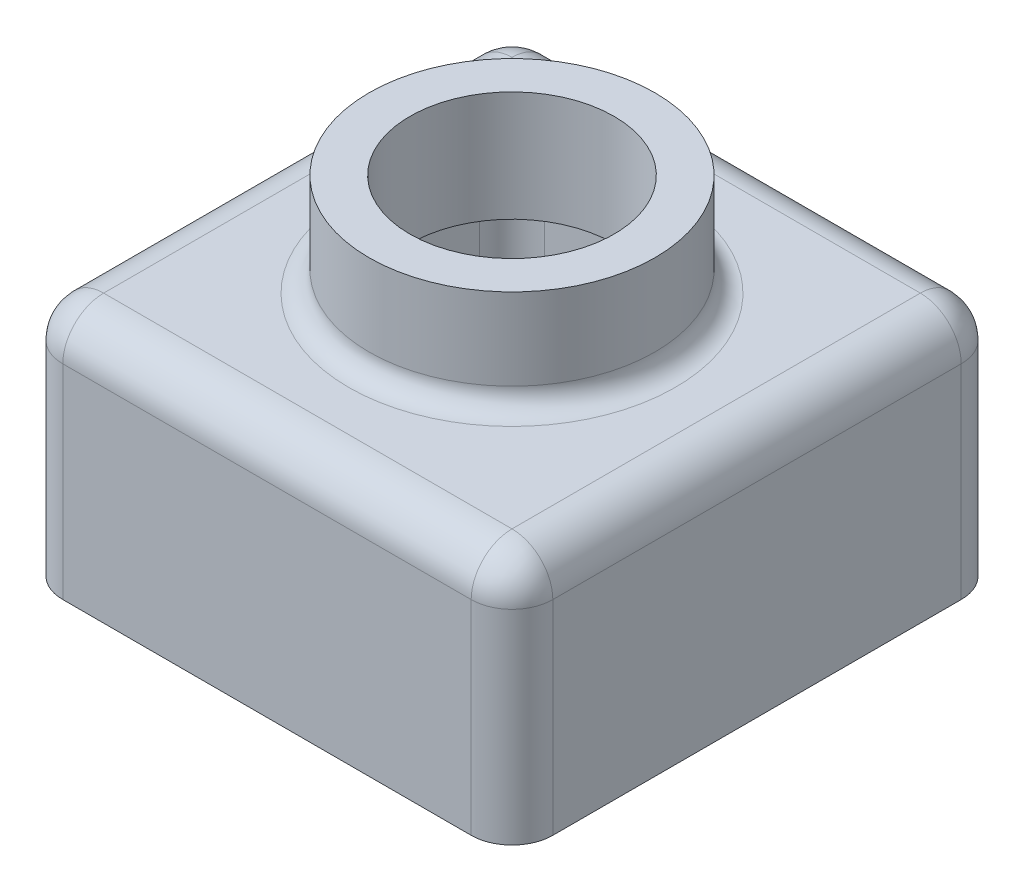
ISO-10303-21;
HEADER;
FILE_DESCRIPTION(('STEP AP214'),'2;1');
FILE_NAME('part.step','',(''),(''),'','','');
FILE_SCHEMA(('AUTOMOTIVE_DESIGN { 1 0 10303 214 1 1 1 1 }'));
ENDSEC;
DATA;
#1=APPLICATION_CONTEXT('core data for automotive mechanical design processes');
#2=APPLICATION_PROTOCOL_DEFINITION('international standard','automotive_design',2000,#1);
#3=PRODUCT_CONTEXT('',#1,'mechanical');
#4=PRODUCT('Part','Part','',(#3));
#5=PRODUCT_RELATED_PRODUCT_CATEGORY('part','',(#4));
#6=PRODUCT_DEFINITION_FORMATION('','',#4);
#7=PRODUCT_DEFINITION_CONTEXT('part definition',#1,'design');
#8=PRODUCT_DEFINITION('design','',#6,#7);
#9=PRODUCT_DEFINITION_SHAPE('','',#8);
#10=(LENGTH_UNIT() NAMED_UNIT(*) SI_UNIT(.MILLI.,.METRE.));
#11=(NAMED_UNIT(*) PLANE_ANGLE_UNIT() SI_UNIT($,.RADIAN.));
#12=(NAMED_UNIT(*) SI_UNIT($,.STERADIAN.) SOLID_ANGLE_UNIT());
#13=UNCERTAINTY_MEASURE_WITH_UNIT(LENGTH_MEASURE(1.E-05),#10,'distance_accuracy_value','');
#14=(GEOMETRIC_REPRESENTATION_CONTEXT(3) GLOBAL_UNCERTAINTY_ASSIGNED_CONTEXT((#13)) GLOBAL_UNIT_ASSIGNED_CONTEXT((#10,
#11,#12)) REPRESENTATION_CONTEXT('',''));
#15=CARTESIAN_POINT('',(0.,0.,0.));
#16=DIRECTION('',(0.,0.,1.));
#17=DIRECTION('',(1.,0.,0.));
#18=AXIS2_PLACEMENT_3D('',#15,#16,#17);
#19=CARTESIAN_POINT('',(0.,0.,0.));
#20=DIRECTION('',(0.,1.,0.));
#21=DIRECTION('',(0.,0.,1.));
#22=AXIS2_PLACEMENT_3D('',#19,#20,#21);
#23=PLANE('',#22);
#24=DIRECTION('',(0.,0.,1.));
#25=VECTOR('',#24,1.);
#26=CARTESIAN_POINT('',(-60.,0.,-60.));
#27=LINE('',#26,#25);
#28=CARTESIAN_POINT('',(-60.,0.,-50.));
#29=VERTEX_POINT('',#28);
#30=CARTESIAN_POINT('',(-60.,0.,50.));
#31=VERTEX_POINT('',#30);
#32=EDGE_CURVE('E336',#29,#31,#27,.T.);
#33=ORIENTED_EDGE('',*,*,#32,.F.);
#34=CARTESIAN_POINT('',(-50.,0.,-50.));
#35=DIRECTION('',(0.,1.,0.));
#36=DIRECTION('',(0.,0.,1.));
#37=AXIS2_PLACEMENT_3D('',#34,#35,#36);
#38=CIRCLE('',#37,10.);
#39=CARTESIAN_POINT('',(-50.,0.,-60.));
#40=VERTEX_POINT('',#39);
#41=EDGE_CURVE('E402',#29,#40,#38,.F.);
#42=ORIENTED_EDGE('',*,*,#41,.T.);
#43=DIRECTION('',(-1.,0.,0.));
#44=VECTOR('',#43,1.);
#45=CARTESIAN_POINT('',(-60.,0.,-60.));
#46=LINE('',#45,#44);
#47=CARTESIAN_POINT('',(50.,0.,-60.));
#48=VERTEX_POINT('',#47);
#49=EDGE_CURVE('E331',#48,#40,#46,.T.);
#50=ORIENTED_EDGE('',*,*,#49,.F.);
#51=CARTESIAN_POINT('',(50.,0.,-50.));
#52=DIRECTION('',(0.,1.,0.));
#53=DIRECTION('',(0.,0.,1.));
#54=AXIS2_PLACEMENT_3D('',#51,#52,#53);
#55=CIRCLE('',#54,10.);
#56=CARTESIAN_POINT('',(60.,0.,-50.));
#57=VERTEX_POINT('',#56);
#58=EDGE_CURVE('E399',#48,#57,#55,.F.);
#59=ORIENTED_EDGE('',*,*,#58,.T.);
#60=DIRECTION('',(0.,0.,-1.));
#61=VECTOR('',#60,1.);
#62=CARTESIAN_POINT('',(60.,0.,-60.));
#63=LINE('',#62,#61);
#64=CARTESIAN_POINT('',(60.,0.,50.));
#65=VERTEX_POINT('',#64);
#66=EDGE_CURVE('E328',#65,#57,#63,.T.);
#67=ORIENTED_EDGE('',*,*,#66,.F.);
#68=CARTESIAN_POINT('',(50.,0.,50.));
#69=DIRECTION('',(0.,1.,0.));
#70=DIRECTION('',(0.,0.,1.));
#71=AXIS2_PLACEMENT_3D('',#68,#69,#70);
#72=CIRCLE('',#71,10.);
#73=CARTESIAN_POINT('',(50.,0.,60.));
#74=VERTEX_POINT('',#73);
#75=EDGE_CURVE('E396',#65,#74,#72,.F.);
#76=ORIENTED_EDGE('',*,*,#75,.T.);
#77=DIRECTION('',(1.,0.,0.));
#78=VECTOR('',#77,1.);
#79=CARTESIAN_POINT('',(-60.,0.,60.));
#80=LINE('',#79,#78);
#81=CARTESIAN_POINT('',(-50.,0.,60.));
#82=VERTEX_POINT('',#81);
#83=EDGE_CURVE('E340',#82,#74,#80,.T.);
#84=ORIENTED_EDGE('',*,*,#83,.F.);
#85=CARTESIAN_POINT('',(-50.,0.,50.));
#86=DIRECTION('',(0.,1.,0.));
#87=DIRECTION('',(0.,0.,1.));
#88=AXIS2_PLACEMENT_3D('',#85,#86,#87);
#89=CIRCLE('',#88,10.);
#90=EDGE_CURVE('E393',#82,#31,#89,.F.);
#91=ORIENTED_EDGE('',*,*,#90,.T.);
#92=EDGE_LOOP('',(#33,#42,#50,#59,#67,#76,#84,#91));
#93=FACE_BOUND('',#92,.T.);
#94=CARTESIAN_POINT('',(-50.,0.,-50.));
#95=DIRECTION('',(0.,1.,0.));
#96=DIRECTION('',(0.,0.,1.));
#97=AXIS2_PLACEMENT_3D('',#94,#95,#96);
#98=CIRCLE('',#97,8.);
#99=CARTESIAN_POINT('',(-58.,0.,-50.));
#100=VERTEX_POINT('',#99);
#101=CARTESIAN_POINT('',(-50.,0.,-58.));
#102=VERTEX_POINT('',#101);
#103=EDGE_CURVE('E319',#100,#102,#98,.F.);
#104=ORIENTED_EDGE('',*,*,#103,.F.);
#105=DIRECTION('',(0.,0.,1.));
#106=VECTOR('',#105,1.);
#107=CARTESIAN_POINT('',(-58.,0.,-60.));
#108=LINE('',#107,#106);
#109=CARTESIAN_POINT('',(-58.,0.,50.));
#110=VERTEX_POINT('',#109);
#111=EDGE_CURVE('E313',#100,#110,#108,.T.);
#112=ORIENTED_EDGE('',*,*,#111,.T.);
#113=CARTESIAN_POINT('',(-50.,0.,50.));
#114=DIRECTION('',(0.,1.,0.));
#115=DIRECTION('',(0.,0.,1.));
#116=AXIS2_PLACEMENT_3D('',#113,#114,#115);
#117=CIRCLE('',#116,8.);
#118=CARTESIAN_POINT('',(-50.,0.,58.));
#119=VERTEX_POINT('',#118);
#120=EDGE_CURVE('E197',#119,#110,#117,.F.);
#121=ORIENTED_EDGE('',*,*,#120,.F.);
#122=DIRECTION('',(1.,0.,0.));
#123=VECTOR('',#122,1.);
#124=CARTESIAN_POINT('',(-60.,0.,58.));
#125=LINE('',#124,#123);
#126=CARTESIAN_POINT('',(50.,0.,58.));
#127=VERTEX_POINT('',#126);
#128=EDGE_CURVE('E61',#119,#127,#125,.T.);
#129=ORIENTED_EDGE('',*,*,#128,.T.);
#130=CARTESIAN_POINT('',(50.,0.,50.));
#131=DIRECTION('',(0.,1.,0.));
#132=DIRECTION('',(0.,0.,1.));
#133=AXIS2_PLACEMENT_3D('',#130,#131,#132);
#134=CIRCLE('',#133,8.);
#135=CARTESIAN_POINT('',(58.,0.,50.));
#136=VERTEX_POINT('',#135);
#137=EDGE_CURVE('E308',#136,#127,#134,.F.);
#138=ORIENTED_EDGE('',*,*,#137,.F.);
#139=DIRECTION('',(0.,0.,-1.));
#140=VECTOR('',#139,1.);
#141=CARTESIAN_POINT('',(58.,0.,-60.));
#142=LINE('',#141,#140);
#143=CARTESIAN_POINT('',(58.,0.,-50.));
#144=VERTEX_POINT('',#143);
#145=EDGE_CURVE('E247',#136,#144,#142,.T.);
#146=ORIENTED_EDGE('',*,*,#145,.T.);
#147=CARTESIAN_POINT('',(50.,0.,-50.));
#148=DIRECTION('',(0.,1.,0.));
#149=DIRECTION('',(0.,0.,1.));
#150=AXIS2_PLACEMENT_3D('',#147,#148,#149);
#151=CIRCLE('',#150,8.);
#152=CARTESIAN_POINT('',(50.,0.,-58.));
#153=VERTEX_POINT('',#152);
#154=EDGE_CURVE('E191',#153,#144,#151,.F.);
#155=ORIENTED_EDGE('',*,*,#154,.F.);
#156=DIRECTION('',(-1.,0.,0.));
#157=VECTOR('',#156,1.);
#158=CARTESIAN_POINT('',(-60.,0.,-58.));
#159=LINE('',#158,#157);
#160=EDGE_CURVE('E307',#153,#102,#159,.T.);
#161=ORIENTED_EDGE('',*,*,#160,.T.);
#162=EDGE_LOOP('',(#104,#112,#121,#129,#138,#146,#155,#161));
#163=FACE_BOUND('',#162,.T.);
#164=ADVANCED_FACE('F45',(#93,#163),#23,.F.);
#165=CARTESIAN_POINT('',(60.,60.,-60.));
#166=DIRECTION('',(-1.,0.,0.));
#167=DIRECTION('',(0.,0.,1.));
#168=AXIS2_PLACEMENT_3D('',#165,#166,#167);
#169=PLANE('',#168);
#170=ORIENTED_EDGE('',*,*,#66,.T.);
#171=DIRECTION('',(0.,-1.,0.));
#172=VECTOR('',#171,1.);
#173=CARTESIAN_POINT('',(60.,60.,-50.));
#174=LINE('',#173,#172);
#175=CARTESIAN_POINT('',(60.,50.,-50.));
#176=VERTEX_POINT('',#175);
#177=EDGE_CURVE('E69',#57,#176,#174,.F.);
#178=ORIENTED_EDGE('',*,*,#177,.T.);
#179=DIRECTION('',(0.,0.,-1.));
#180=VECTOR('',#179,1.);
#181=CARTESIAN_POINT('',(60.,50.,60.));
#182=LINE('',#181,#180);
#183=CARTESIAN_POINT('',(60.,50.,50.));
#184=VERTEX_POINT('',#183);
#185=EDGE_CURVE('E388',#176,#184,#182,.F.);
#186=ORIENTED_EDGE('',*,*,#185,.T.);
#187=DIRECTION('',(0.,-1.,0.));
#188=VECTOR('',#187,1.);
#189=CARTESIAN_POINT('',(60.,60.,50.));
#190=LINE('',#189,#188);
#191=EDGE_CURVE('E385',#184,#65,#190,.T.);
#192=ORIENTED_EDGE('',*,*,#191,.T.);
#193=EDGE_LOOP('',(#170,#178,#186,#192));
#194=FACE_BOUND('',#193,.T.);
#195=ADVANCED_FACE('F467',(#194),#169,.F.);
#196=CARTESIAN_POINT('',(-60.,60.,-60.));
#197=DIRECTION('',(0.,0.,1.));
#198=DIRECTION('',(1.,0.,0.));
#199=AXIS2_PLACEMENT_3D('',#196,#197,#198);
#200=PLANE('',#199);
#201=ORIENTED_EDGE('',*,*,#49,.T.);
#202=DIRECTION('',(0.,-1.,0.));
#203=VECTOR('',#202,1.);
#204=CARTESIAN_POINT('',(-50.,60.,-60.));
#205=LINE('',#204,#203);
#206=CARTESIAN_POINT('',(-50.,50.,-60.));
#207=VERTEX_POINT('',#206);
#208=EDGE_CURVE('E382',#40,#207,#205,.F.);
#209=ORIENTED_EDGE('',*,*,#208,.T.);
#210=DIRECTION('',(-1.,0.,0.));
#211=VECTOR('',#210,1.);
#212=CARTESIAN_POINT('',(60.,50.,-60.));
#213=LINE('',#212,#211);
#214=CARTESIAN_POINT('',(50.,50.,-60.));
#215=VERTEX_POINT('',#214);
#216=EDGE_CURVE('E379',#207,#215,#213,.F.);
#217=ORIENTED_EDGE('',*,*,#216,.T.);
#218=DIRECTION('',(0.,-1.,0.));
#219=VECTOR('',#218,1.);
#220=CARTESIAN_POINT('',(50.,60.,-60.));
#221=LINE('',#220,#219);
#222=EDGE_CURVE('E376',#215,#48,#221,.T.);
#223=ORIENTED_EDGE('',*,*,#222,.T.);
#224=EDGE_LOOP('',(#201,#209,#217,#223));
#225=FACE_BOUND('',#224,.T.);
#226=ADVANCED_FACE('F475',(#225),#200,.F.);
#227=CARTESIAN_POINT('',(-60.,60.,-60.));
#228=DIRECTION('',(1.,0.,0.));
#229=DIRECTION('',(0.,0.,-1.));
#230=AXIS2_PLACEMENT_3D('',#227,#228,#229);
#231=PLANE('',#230);
#232=DIRECTION('',(0.,0.,1.));
#233=VECTOR('',#232,1.);
#234=CARTESIAN_POINT('',(-60.,50.,-60.));
#235=LINE('',#234,#233);
#236=CARTESIAN_POINT('',(-60.,50.,50.));
#237=VERTEX_POINT('',#236);
#238=CARTESIAN_POINT('',(-60.,50.,-50.));
#239=VERTEX_POINT('',#238);
#240=EDGE_CURVE('E370',#237,#239,#235,.F.);
#241=ORIENTED_EDGE('',*,*,#240,.T.);
#242=DIRECTION('',(0.,-1.,0.));
#243=VECTOR('',#242,1.);
#244=CARTESIAN_POINT('',(-60.,60.,-50.));
#245=LINE('',#244,#243);
#246=EDGE_CURVE('E373',#239,#29,#245,.T.);
#247=ORIENTED_EDGE('',*,*,#246,.T.);
#248=ORIENTED_EDGE('',*,*,#32,.T.);
#249=DIRECTION('',(0.,-1.,0.));
#250=VECTOR('',#249,1.);
#251=CARTESIAN_POINT('',(-60.,60.,50.));
#252=LINE('',#251,#250);
#253=EDGE_CURVE('E367',#31,#237,#252,.F.);
#254=ORIENTED_EDGE('',*,*,#253,.T.);
#255=EDGE_LOOP('',(#241,#247,#248,#254));
#256=FACE_BOUND('',#255,.T.);
#257=ADVANCED_FACE('F486',(#256),#231,.F.);
#258=CARTESIAN_POINT('',(-60.,60.,60.));
#259=DIRECTION('',(0.,0.,-1.));
#260=DIRECTION('',(-1.,0.,0.));
#261=AXIS2_PLACEMENT_3D('',#258,#259,#260);
#262=PLANE('',#261);
#263=ORIENTED_EDGE('',*,*,#83,.T.);
#264=DIRECTION('',(0.,-1.,0.));
#265=VECTOR('',#264,1.);
#266=CARTESIAN_POINT('',(50.,60.,60.));
#267=LINE('',#266,#265);
#268=CARTESIAN_POINT('',(50.,50.,60.));
#269=VERTEX_POINT('',#268);
#270=EDGE_CURVE('E364',#74,#269,#267,.F.);
#271=ORIENTED_EDGE('',*,*,#270,.T.);
#272=DIRECTION('',(1.,0.,0.));
#273=VECTOR('',#272,1.);
#274=CARTESIAN_POINT('',(-60.,50.,60.));
#275=LINE('',#274,#273);
#276=CARTESIAN_POINT('',(-50.,50.,60.));
#277=VERTEX_POINT('',#276);
#278=EDGE_CURVE('E360',#269,#277,#275,.F.);
#279=ORIENTED_EDGE('',*,*,#278,.T.);
#280=DIRECTION('',(0.,-1.,0.));
#281=VECTOR('',#280,1.);
#282=CARTESIAN_POINT('',(-50.,60.,60.));
#283=LINE('',#282,#281);
#284=EDGE_CURVE('E357',#277,#82,#283,.T.);
#285=ORIENTED_EDGE('',*,*,#284,.T.);
#286=EDGE_LOOP('',(#263,#271,#279,#285));
#287=FACE_BOUND('',#286,.T.);
#288=ADVANCED_FACE('F483',(#287),#262,.F.);
#289=CARTESIAN_POINT('',(0.,60.,0.));
#290=DIRECTION('',(0.,1.,0.));
#291=DIRECTION('',(0.,0.,1.));
#292=AXIS2_PLACEMENT_3D('',#289,#290,#291);
#293=PLANE('',#292);
#294=CARTESIAN_POINT('',(0.,60.,0.));
#295=DIRECTION('',(0.,1.,0.));
#296=DIRECTION('',(0.,0.,1.));
#297=AXIS2_PLACEMENT_3D('',#294,#295,#296);
#298=CIRCLE('',#297,40.);
#299=CARTESIAN_POINT('',(0.,60.,40.));
#300=VERTEX_POINT('',#299);
#301=EDGE_CURVE('E11',#300,#300,#298,.F.);
#302=ORIENTED_EDGE('',*,*,#301,.T.);
#303=EDGE_LOOP('',(#302));
#304=FACE_BOUND('',#303,.T.);
#305=DIRECTION('',(0.,0.,1.));
#306=VECTOR('',#305,1.);
#307=CARTESIAN_POINT('',(-50.,60.,60.));
#308=LINE('',#307,#306);
#309=CARTESIAN_POINT('',(-50.,60.,-50.));
#310=VERTEX_POINT('',#309);
#311=CARTESIAN_POINT('',(-50.,60.,50.));
#312=VERTEX_POINT('',#311);
#313=EDGE_CURVE('E350',#310,#312,#308,.T.);
#314=ORIENTED_EDGE('',*,*,#313,.T.);
#315=DIRECTION('',(1.,0.,0.));
#316=VECTOR('',#315,1.);
#317=CARTESIAN_POINT('',(60.,60.,50.));
#318=LINE('',#317,#316);
#319=CARTESIAN_POINT('',(50.,60.,50.));
#320=VERTEX_POINT('',#319);
#321=EDGE_CURVE('E353',#312,#320,#318,.T.);
#322=ORIENTED_EDGE('',*,*,#321,.T.);
#323=DIRECTION('',(0.,0.,-1.));
#324=VECTOR('',#323,1.);
#325=CARTESIAN_POINT('',(50.,60.,-60.));
#326=LINE('',#325,#324);
#327=CARTESIAN_POINT('',(50.,60.,-50.));
#328=VERTEX_POINT('',#327);
#329=EDGE_CURVE('E344',#320,#328,#326,.T.);
#330=ORIENTED_EDGE('',*,*,#329,.T.);
#331=DIRECTION('',(-1.,0.,0.));
#332=VECTOR('',#331,1.);
#333=CARTESIAN_POINT('',(-60.,60.,-50.));
#334=LINE('',#333,#332);
#335=EDGE_CURVE('E347',#328,#310,#334,.T.);
#336=ORIENTED_EDGE('',*,*,#335,.T.);
#337=EDGE_LOOP('',(#314,#322,#330,#336));
#338=FACE_BOUND('',#337,.T.);
#339=ADVANCED_FACE('F481',(#304,#338),#293,.T.);
#340=CARTESIAN_POINT('',(-50.,60.,-50.));
#341=DIRECTION('',(0.,-1.,0.));
#342=DIRECTION('',(0.,0.,-1.));
#343=AXIS2_PLACEMENT_3D('',#340,#341,#342);
#344=CYLINDRICAL_SURFACE('',#343,10.);
#345=ORIENTED_EDGE('',*,*,#41,.F.);
#346=ORIENTED_EDGE('',*,*,#246,.F.);
#347=CARTESIAN_POINT('',(-50.,50.,-50.));
#348=DIRECTION('',(0.,1.,0.));
#349=DIRECTION('',(0.,0.,1.));
#350=AXIS2_PLACEMENT_3D('',#347,#348,#349);
#351=CIRCLE('',#350,10.);
#352=EDGE_CURVE('E332',#207,#239,#351,.T.);
#353=ORIENTED_EDGE('',*,*,#352,.F.);
#354=ORIENTED_EDGE('',*,*,#208,.F.);
#355=EDGE_LOOP('',(#345,#346,#353,#354));
#356=FACE_BOUND('',#355,.T.);
#357=ADVANCED_FACE('F535',(#356),#344,.T.);
#358=CARTESIAN_POINT('',(0.,50.,-50.));
#359=DIRECTION('',(1.,0.,0.));
#360=DIRECTION('',(0.,0.,-1.));
#361=AXIS2_PLACEMENT_3D('',#358,#359,#360);
#362=CYLINDRICAL_SURFACE('',#361,10.);
#363=CARTESIAN_POINT('',(50.,50.,-50.));
#364=DIRECTION('',(1.,0.,0.));
#365=DIRECTION('',(0.,1.,0.));
#366=AXIS2_PLACEMENT_3D('',#363,#364,#365);
#367=CIRCLE('',#366,10.);
#368=EDGE_CURVE('E438',#215,#328,#367,.T.);
#369=ORIENTED_EDGE('',*,*,#368,.F.);
#370=ORIENTED_EDGE('',*,*,#216,.F.);
#371=CARTESIAN_POINT('',(-50.,50.,-50.));
#372=DIRECTION('',(-1.,0.,0.));
#373=DIRECTION('',(0.,0.,1.));
#374=AXIS2_PLACEMENT_3D('',#371,#372,#373);
#375=CIRCLE('',#374,10.);
#376=EDGE_CURVE('E442',#310,#207,#375,.T.);
#377=ORIENTED_EDGE('',*,*,#376,.F.);
#378=ORIENTED_EDGE('',*,*,#335,.F.);
#379=EDGE_LOOP('',(#369,#370,#377,#378));
#380=FACE_BOUND('',#379,.T.);
#381=ADVANCED_FACE('F532',(#380),#362,.T.);
#382=CARTESIAN_POINT('',(50.,60.,-50.));
#383=DIRECTION('',(0.,-1.,0.));
#384=DIRECTION('',(0.,0.,-1.));
#385=AXIS2_PLACEMENT_3D('',#382,#383,#384);
#386=CYLINDRICAL_SURFACE('',#385,10.);
#387=ORIENTED_EDGE('',*,*,#58,.F.);
#388=ORIENTED_EDGE('',*,*,#222,.F.);
#389=CARTESIAN_POINT('',(50.,50.,-50.));
#390=DIRECTION('',(0.,1.,0.));
#391=DIRECTION('',(0.,0.,1.));
#392=AXIS2_PLACEMENT_3D('',#389,#390,#391);
#393=CIRCLE('',#392,10.);
#394=EDGE_CURVE('E434',#176,#215,#393,.T.);
#395=ORIENTED_EDGE('',*,*,#394,.F.);
#396=ORIENTED_EDGE('',*,*,#177,.F.);
#397=EDGE_LOOP('',(#387,#388,#395,#396));
#398=FACE_BOUND('',#397,.T.);
#399=ADVANCED_FACE('F528',(#398),#386,.T.);
#400=CARTESIAN_POINT('',(-50.,50.,-50.));
#401=DIRECTION('',(0.,0.,-1.));
#402=DIRECTION('',(-1.,0.,0.));
#403=AXIS2_PLACEMENT_3D('',#400,#401,#402);
#404=SPHERICAL_SURFACE('',#403,10.);
#405=ORIENTED_EDGE('',*,*,#376,.T.);
#406=ORIENTED_EDGE('',*,*,#352,.T.);
#407=CARTESIAN_POINT('',(-50.,50.,-50.));
#408=DIRECTION('',(0.,0.,-1.));
#409=DIRECTION('',(-1.,0.,0.));
#410=AXIS2_PLACEMENT_3D('',#407,#408,#409);
#411=CIRCLE('',#410,10.);
#412=EDGE_CURVE('E430',#310,#239,#411,.F.);
#413=ORIENTED_EDGE('',*,*,#412,.F.);
#414=EDGE_LOOP('',(#405,#406,#413));
#415=FACE_BOUND('',#414,.T.);
#416=ADVANCED_FACE('F524',(#415),#404,.T.);
#417=CARTESIAN_POINT('',(50.,50.,-50.));
#418=DIRECTION('',(0.,0.,-1.));
#419=DIRECTION('',(-1.,0.,0.));
#420=AXIS2_PLACEMENT_3D('',#417,#418,#419);
#421=SPHERICAL_SURFACE('',#420,10.);
#422=ORIENTED_EDGE('',*,*,#394,.T.);
#423=ORIENTED_EDGE('',*,*,#368,.T.);
#424=CARTESIAN_POINT('',(50.,50.,-50.));
#425=DIRECTION('',(0.,0.,-1.));
#426=DIRECTION('',(-1.,0.,0.));
#427=AXIS2_PLACEMENT_3D('',#424,#425,#426);
#428=CIRCLE('',#427,10.);
#429=EDGE_CURVE('E426',#176,#328,#428,.F.);
#430=ORIENTED_EDGE('',*,*,#429,.F.);
#431=EDGE_LOOP('',(#422,#423,#430));
#432=FACE_BOUND('',#431,.T.);
#433=ADVANCED_FACE('F520',(#432),#421,.T.);
#434=CARTESIAN_POINT('',(-50.,60.,50.));
#435=DIRECTION('',(0.,-1.,0.));
#436=DIRECTION('',(0.,0.,-1.));
#437=AXIS2_PLACEMENT_3D('',#434,#435,#436);
#438=CYLINDRICAL_SURFACE('',#437,10.);
#439=ORIENTED_EDGE('',*,*,#90,.F.);
#440=ORIENTED_EDGE('',*,*,#284,.F.);
#441=CARTESIAN_POINT('',(-50.,50.,50.));
#442=DIRECTION('',(0.,1.,0.));
#443=DIRECTION('',(0.,0.,1.));
#444=AXIS2_PLACEMENT_3D('',#441,#442,#443);
#445=CIRCLE('',#444,10.);
#446=EDGE_CURVE('E422',#237,#277,#445,.T.);
#447=ORIENTED_EDGE('',*,*,#446,.F.);
#448=ORIENTED_EDGE('',*,*,#253,.F.);
#449=EDGE_LOOP('',(#439,#440,#447,#448));
#450=FACE_BOUND('',#449,.T.);
#451=ADVANCED_FACE('F516',(#450),#438,.T.);
#452=CARTESIAN_POINT('',(-50.,50.,0.));
#453=DIRECTION('',(0.,0.,-1.));
#454=DIRECTION('',(-1.,0.,0.));
#455=AXIS2_PLACEMENT_3D('',#452,#453,#454);
#456=CYLINDRICAL_SURFACE('',#455,10.);
#457=ORIENTED_EDGE('',*,*,#412,.T.);
#458=ORIENTED_EDGE('',*,*,#240,.F.);
#459=CARTESIAN_POINT('',(-50.,50.,50.));
#460=DIRECTION('',(0.,0.,1.));
#461=DIRECTION('',(1.,0.,0.));
#462=AXIS2_PLACEMENT_3D('',#459,#460,#461);
#463=CIRCLE('',#462,10.);
#464=EDGE_CURVE('E418',#312,#237,#463,.T.);
#465=ORIENTED_EDGE('',*,*,#464,.F.);
#466=ORIENTED_EDGE('',*,*,#313,.F.);
#467=EDGE_LOOP('',(#457,#458,#465,#466));
#468=FACE_BOUND('',#467,.T.);
#469=ADVANCED_FACE('F512',(#468),#456,.T.);
#470=CARTESIAN_POINT('',(50.,50.,0.));
#471=DIRECTION('',(0.,0.,1.));
#472=DIRECTION('',(1.,0.,0.));
#473=AXIS2_PLACEMENT_3D('',#470,#471,#472);
#474=CYLINDRICAL_SURFACE('',#473,10.);
#475=ORIENTED_EDGE('',*,*,#429,.T.);
#476=ORIENTED_EDGE('',*,*,#329,.F.);
#477=CARTESIAN_POINT('',(50.,50.,50.));
#478=DIRECTION('',(0.,0.,1.));
#479=DIRECTION('',(0.,-1.,0.));
#480=AXIS2_PLACEMENT_3D('',#477,#478,#479);
#481=CIRCLE('',#480,10.);
#482=EDGE_CURVE('E414',#184,#320,#481,.T.);
#483=ORIENTED_EDGE('',*,*,#482,.F.);
#484=ORIENTED_EDGE('',*,*,#185,.F.);
#485=EDGE_LOOP('',(#475,#476,#483,#484));
#486=FACE_BOUND('',#485,.T.);
#487=ADVANCED_FACE('F508',(#486),#474,.T.);
#488=CARTESIAN_POINT('',(50.,60.,50.));
#489=DIRECTION('',(0.,-1.,0.));
#490=DIRECTION('',(0.,0.,-1.));
#491=AXIS2_PLACEMENT_3D('',#488,#489,#490);
#492=CYLINDRICAL_SURFACE('',#491,10.);
#493=ORIENTED_EDGE('',*,*,#75,.F.);
#494=ORIENTED_EDGE('',*,*,#191,.F.);
#495=CARTESIAN_POINT('',(50.,50.,50.));
#496=DIRECTION('',(0.,1.,0.));
#497=DIRECTION('',(0.,0.,1.));
#498=AXIS2_PLACEMENT_3D('',#495,#496,#497);
#499=CIRCLE('',#498,10.);
#500=EDGE_CURVE('E410',#269,#184,#499,.T.);
#501=ORIENTED_EDGE('',*,*,#500,.F.);
#502=ORIENTED_EDGE('',*,*,#270,.F.);
#503=EDGE_LOOP('',(#493,#494,#501,#502));
#504=FACE_BOUND('',#503,.T.);
#505=ADVANCED_FACE('F504',(#504),#492,.T.);
#506=CARTESIAN_POINT('',(-50.,50.,50.));
#507=DIRECTION('',(-1.,0.,0.));
#508=DIRECTION('',(0.,0.,1.));
#509=AXIS2_PLACEMENT_3D('',#506,#507,#508);
#510=SPHERICAL_SURFACE('',#509,10.);
#511=ORIENTED_EDGE('',*,*,#464,.T.);
#512=ORIENTED_EDGE('',*,*,#446,.T.);
#513=CARTESIAN_POINT('',(-50.,50.,50.));
#514=DIRECTION('',(-1.,0.,0.));
#515=DIRECTION('',(0.,0.,1.));
#516=AXIS2_PLACEMENT_3D('',#513,#514,#515);
#517=CIRCLE('',#516,10.);
#518=EDGE_CURVE('E407',#312,#277,#517,.F.);
#519=ORIENTED_EDGE('',*,*,#518,.F.);
#520=EDGE_LOOP('',(#511,#512,#519));
#521=FACE_BOUND('',#520,.T.);
#522=ADVANCED_FACE('F500',(#521),#510,.T.);
#523=CARTESIAN_POINT('',(50.,50.,50.));
#524=DIRECTION('',(1.,0.,0.));
#525=DIRECTION('',(0.,0.,-1.));
#526=AXIS2_PLACEMENT_3D('',#523,#524,#525);
#527=SPHERICAL_SURFACE('',#526,10.);
#528=ORIENTED_EDGE('',*,*,#500,.T.);
#529=ORIENTED_EDGE('',*,*,#482,.T.);
#530=CARTESIAN_POINT('',(50.,50.,50.));
#531=DIRECTION('',(1.,0.,0.));
#532=DIRECTION('',(0.,0.,-1.));
#533=AXIS2_PLACEMENT_3D('',#530,#531,#532);
#534=CIRCLE('',#533,10.);
#535=EDGE_CURVE('E322',#269,#320,#534,.F.);
#536=ORIENTED_EDGE('',*,*,#535,.F.);
#537=EDGE_LOOP('',(#528,#529,#536));
#538=FACE_BOUND('',#537,.T.);
#539=ADVANCED_FACE('F496',(#538),#527,.T.);
#540=CARTESIAN_POINT('',(0.,50.,50.));
#541=DIRECTION('',(-1.,0.,0.));
#542=DIRECTION('',(0.,0.,1.));
#543=AXIS2_PLACEMENT_3D('',#540,#541,#542);
#544=CYLINDRICAL_SURFACE('',#543,10.);
#545=ORIENTED_EDGE('',*,*,#518,.T.);
#546=ORIENTED_EDGE('',*,*,#278,.F.);
#547=ORIENTED_EDGE('',*,*,#535,.T.);
#548=ORIENTED_EDGE('',*,*,#321,.F.);
#549=EDGE_LOOP('',(#545,#546,#547,#548));
#550=FACE_BOUND('',#549,.T.);
#551=ADVANCED_FACE('F494',(#550),#544,.T.);
#552=CARTESIAN_POINT('',(58.,60.,-60.));
#553=DIRECTION('',(-1.,0.,0.));
#554=DIRECTION('',(0.,0.,1.));
#555=AXIS2_PLACEMENT_3D('',#552,#553,#554);
#556=PLANE('',#555);
#557=ORIENTED_EDGE('',*,*,#145,.F.);
#558=DIRECTION('',(0.,1.,0.));
#559=VECTOR('',#558,1.);
#560=CARTESIAN_POINT('',(58.,60.,50.));
#561=LINE('',#560,#559);
#562=CARTESIAN_POINT('',(58.,50.,50.));
#563=VERTEX_POINT('',#562);
#564=EDGE_CURVE('E222',#563,#136,#561,.F.);
#565=ORIENTED_EDGE('',*,*,#564,.F.);
#566=DIRECTION('',(0.,0.,1.));
#567=VECTOR('',#566,1.);
#568=CARTESIAN_POINT('',(58.,50.,-60.));
#569=LINE('',#568,#567);
#570=CARTESIAN_POINT('',(58.,50.,-50.));
#571=VERTEX_POINT('',#570);
#572=EDGE_CURVE('E198',#571,#563,#569,.T.);
#573=ORIENTED_EDGE('',*,*,#572,.F.);
#574=DIRECTION('',(0.,1.,0.));
#575=VECTOR('',#574,1.);
#576=CARTESIAN_POINT('',(58.,60.,-50.));
#577=LINE('',#576,#575);
#578=EDGE_CURVE('E186',#144,#571,#577,.T.);
#579=ORIENTED_EDGE('',*,*,#578,.F.);
#580=EDGE_LOOP('',(#557,#565,#573,#579));
#581=FACE_BOUND('',#580,.T.);
#582=ADVANCED_FACE('F221',(#581),#556,.T.);
#583=CARTESIAN_POINT('',(-60.,60.,-58.));
#584=DIRECTION('',(0.,0.,1.));
#585=DIRECTION('',(1.,0.,0.));
#586=AXIS2_PLACEMENT_3D('',#583,#584,#585);
#587=PLANE('',#586);
#588=ORIENTED_EDGE('',*,*,#160,.F.);
#589=DIRECTION('',(0.,1.,0.));
#590=VECTOR('',#589,1.);
#591=CARTESIAN_POINT('',(50.,60.,-58.));
#592=LINE('',#591,#590);
#593=CARTESIAN_POINT('',(50.,50.,-58.));
#594=VERTEX_POINT('',#593);
#595=EDGE_CURVE('E231',#594,#153,#592,.F.);
#596=ORIENTED_EDGE('',*,*,#595,.F.);
#597=DIRECTION('',(1.,0.,0.));
#598=VECTOR('',#597,1.);
#599=CARTESIAN_POINT('',(-60.,50.,-58.));
#600=LINE('',#599,#598);
#601=CARTESIAN_POINT('',(-50.,50.,-58.));
#602=VERTEX_POINT('',#601);
#603=EDGE_CURVE('E233',#602,#594,#600,.T.);
#604=ORIENTED_EDGE('',*,*,#603,.F.);
#605=DIRECTION('',(0.,1.,0.));
#606=VECTOR('',#605,1.);
#607=CARTESIAN_POINT('',(-50.,60.,-58.));
#608=LINE('',#607,#606);
#609=EDGE_CURVE('E227',#102,#602,#608,.T.);
#610=ORIENTED_EDGE('',*,*,#609,.F.);
#611=EDGE_LOOP('',(#588,#596,#604,#610));
#612=FACE_BOUND('',#611,.T.);
#613=ADVANCED_FACE('F732',(#612),#587,.T.);
#614=CARTESIAN_POINT('',(-58.,60.,-60.));
#615=DIRECTION('',(1.,0.,0.));
#616=DIRECTION('',(0.,0.,-1.));
#617=AXIS2_PLACEMENT_3D('',#614,#615,#616);
#618=PLANE('',#617);
#619=DIRECTION('',(0.,0.,-1.));
#620=VECTOR('',#619,1.);
#621=CARTESIAN_POINT('',(-58.,50.,-60.));
#622=LINE('',#621,#620);
#623=CARTESIAN_POINT('',(-58.,50.,50.));
#624=VERTEX_POINT('',#623);
#625=CARTESIAN_POINT('',(-58.,50.,-50.));
#626=VERTEX_POINT('',#625);
#627=EDGE_CURVE('E242',#624,#626,#622,.T.);
#628=ORIENTED_EDGE('',*,*,#627,.F.);
#629=DIRECTION('',(0.,1.,0.));
#630=VECTOR('',#629,1.);
#631=CARTESIAN_POINT('',(-58.,60.,50.));
#632=LINE('',#631,#630);
#633=EDGE_CURVE('E251',#110,#624,#632,.T.);
#634=ORIENTED_EDGE('',*,*,#633,.F.);
#635=ORIENTED_EDGE('',*,*,#111,.F.);
#636=DIRECTION('',(0.,1.,0.));
#637=VECTOR('',#636,1.);
#638=CARTESIAN_POINT('',(-58.,60.,-50.));
#639=LINE('',#638,#637);
#640=EDGE_CURVE('E234',#626,#100,#639,.F.);
#641=ORIENTED_EDGE('',*,*,#640,.F.);
#642=EDGE_LOOP('',(#628,#634,#635,#641));
#643=FACE_BOUND('',#642,.T.);
#644=ADVANCED_FACE('F724',(#643),#618,.T.);
#645=CARTESIAN_POINT('',(-60.,60.,58.));
#646=DIRECTION('',(0.,0.,-1.));
#647=DIRECTION('',(-1.,0.,0.));
#648=AXIS2_PLACEMENT_3D('',#645,#646,#647);
#649=PLANE('',#648);
#650=ORIENTED_EDGE('',*,*,#128,.F.);
#651=DIRECTION('',(0.,1.,0.));
#652=VECTOR('',#651,1.);
#653=CARTESIAN_POINT('',(-50.,60.,58.));
#654=LINE('',#653,#652);
#655=CARTESIAN_POINT('',(-50.,50.,58.));
#656=VERTEX_POINT('',#655);
#657=EDGE_CURVE('E269',#656,#119,#654,.F.);
#658=ORIENTED_EDGE('',*,*,#657,.F.);
#659=DIRECTION('',(-1.,0.,0.));
#660=VECTOR('',#659,1.);
#661=CARTESIAN_POINT('',(-60.,50.,58.));
#662=LINE('',#661,#660);
#663=CARTESIAN_POINT('',(50.,50.,58.));
#664=VERTEX_POINT('',#663);
#665=EDGE_CURVE('E287',#664,#656,#662,.T.);
#666=ORIENTED_EDGE('',*,*,#665,.F.);
#667=DIRECTION('',(0.,1.,0.));
#668=VECTOR('',#667,1.);
#669=CARTESIAN_POINT('',(50.,60.,58.));
#670=LINE('',#669,#668);
#671=EDGE_CURVE('E254',#127,#664,#670,.T.);
#672=ORIENTED_EDGE('',*,*,#671,.F.);
#673=EDGE_LOOP('',(#650,#658,#666,#672));
#674=FACE_BOUND('',#673,.T.);
#675=ADVANCED_FACE('F621',(#674),#649,.T.);
#676=CARTESIAN_POINT('',(0.,58.,0.));
#677=DIRECTION('',(0.,1.,0.));
#678=DIRECTION('',(0.,0.,1.));
#679=AXIS2_PLACEMENT_3D('',#676,#677,#678);
#680=PLANE('',#679);
#681=CARTESIAN_POINT('',(0.,58.,0.));
#682=DIRECTION('',(0.,1.,0.));
#683=DIRECTION('',(0.,0.,1.));
#684=AXIS2_PLACEMENT_3D('',#681,#682,#683);
#685=CIRCLE('',#684,25.);
#686=CARTESIAN_POINT('',(0.,58.,25.));
#687=VERTEX_POINT('',#686);
#688=EDGE_CURVE('E891',#687,#687,#685,.T.);
#689=ORIENTED_EDGE('',*,*,#688,.T.);
#690=EDGE_LOOP('',(#689));
#691=FACE_BOUND('',#690,.T.);
#692=DIRECTION('',(0.,0.,1.));
#693=VECTOR('',#692,1.);
#694=CARTESIAN_POINT('',(-50.,58.,0.));
#695=LINE('',#694,#693);
#696=CARTESIAN_POINT('',(-50.,58.,-50.));
#697=VERTEX_POINT('',#696);
#698=CARTESIAN_POINT('',(-50.,58.,50.));
#699=VERTEX_POINT('',#698);
#700=EDGE_CURVE('E261',#697,#699,#695,.T.);
#701=ORIENTED_EDGE('',*,*,#700,.F.);
#702=DIRECTION('',(1.,0.,0.));
#703=VECTOR('',#702,1.);
#704=CARTESIAN_POINT('',(0.,58.,-50.));
#705=LINE('',#704,#703);
#706=CARTESIAN_POINT('',(50.,58.,-50.));
#707=VERTEX_POINT('',#706);
#708=EDGE_CURVE('E265',#707,#697,#705,.F.);
#709=ORIENTED_EDGE('',*,*,#708,.F.);
#710=DIRECTION('',(0.,0.,1.));
#711=VECTOR('',#710,1.);
#712=CARTESIAN_POINT('',(50.,58.,0.));
#713=LINE('',#712,#711);
#714=CARTESIAN_POINT('',(50.,58.,50.));
#715=VERTEX_POINT('',#714);
#716=EDGE_CURVE('E216',#715,#707,#713,.F.);
#717=ORIENTED_EDGE('',*,*,#716,.F.);
#718=DIRECTION('',(1.,0.,0.));
#719=VECTOR('',#718,1.);
#720=CARTESIAN_POINT('',(0.,58.,50.));
#721=LINE('',#720,#719);
#722=EDGE_CURVE('E264',#699,#715,#721,.T.);
#723=ORIENTED_EDGE('',*,*,#722,.F.);
#724=EDGE_LOOP('',(#701,#709,#717,#723));
#725=FACE_BOUND('',#724,.T.);
#726=ADVANCED_FACE('F617',(#691,#725),#680,.F.);
#727=CARTESIAN_POINT('',(-50.,60.,-50.));
#728=DIRECTION('',(0.,-1.,0.));
#729=DIRECTION('',(0.,0.,-1.));
#730=AXIS2_PLACEMENT_3D('',#727,#728,#729);
#731=CYLINDRICAL_SURFACE('',#730,8.);
#732=ORIENTED_EDGE('',*,*,#103,.T.);
#733=ORIENTED_EDGE('',*,*,#609,.T.);
#734=CARTESIAN_POINT('',(-50.,50.,-50.));
#735=DIRECTION('',(0.,-1.,0.));
#736=DIRECTION('',(0.,0.,-1.));
#737=AXIS2_PLACEMENT_3D('',#734,#735,#736);
#738=CIRCLE('',#737,8.);
#739=EDGE_CURVE('E243',#602,#626,#738,.F.);
#740=ORIENTED_EDGE('',*,*,#739,.T.);
#741=ORIENTED_EDGE('',*,*,#640,.T.);
#742=EDGE_LOOP('',(#732,#733,#740,#741));
#743=FACE_BOUND('',#742,.T.);
#744=ADVANCED_FACE('F620',(#743),#731,.F.);
#745=CARTESIAN_POINT('',(0.,50.,-50.));
#746=DIRECTION('',(1.,0.,0.));
#747=DIRECTION('',(0.,0.,-1.));
#748=AXIS2_PLACEMENT_3D('',#745,#746,#747);
#749=CYLINDRICAL_SURFACE('',#748,8.);
#750=CARTESIAN_POINT('',(50.,50.,-50.));
#751=DIRECTION('',(-1.,0.,0.));
#752=DIRECTION('',(0.,0.,1.));
#753=AXIS2_PLACEMENT_3D('',#750,#751,#752);
#754=CIRCLE('',#753,8.);
#755=EDGE_CURVE('E207',#594,#707,#754,.F.);
#756=ORIENTED_EDGE('',*,*,#755,.T.);
#757=ORIENTED_EDGE('',*,*,#708,.T.);
#758=CARTESIAN_POINT('',(-50.,50.,-50.));
#759=DIRECTION('',(-1.,0.,0.));
#760=DIRECTION('',(0.,-1.,0.));
#761=AXIS2_PLACEMENT_3D('',#758,#759,#760);
#762=CIRCLE('',#761,8.);
#763=EDGE_CURVE('E248',#697,#602,#762,.T.);
#764=ORIENTED_EDGE('',*,*,#763,.T.);
#765=ORIENTED_EDGE('',*,*,#603,.T.);
#766=EDGE_LOOP('',(#756,#757,#764,#765));
#767=FACE_BOUND('',#766,.T.);
#768=ADVANCED_FACE('F702',(#767),#749,.F.);
#769=CARTESIAN_POINT('',(50.,60.,-50.));
#770=DIRECTION('',(0.,-1.,0.));
#771=DIRECTION('',(0.,0.,-1.));
#772=AXIS2_PLACEMENT_3D('',#769,#770,#771);
#773=CYLINDRICAL_SURFACE('',#772,8.);
#774=ORIENTED_EDGE('',*,*,#154,.T.);
#775=ORIENTED_EDGE('',*,*,#578,.T.);
#776=CARTESIAN_POINT('',(50.,50.,-50.));
#777=DIRECTION('',(0.,1.,0.));
#778=DIRECTION('',(-1.,0.,0.));
#779=AXIS2_PLACEMENT_3D('',#776,#777,#778);
#780=CIRCLE('',#779,8.);
#781=EDGE_CURVE('E189',#571,#594,#780,.T.);
#782=ORIENTED_EDGE('',*,*,#781,.T.);
#783=ORIENTED_EDGE('',*,*,#595,.T.);
#784=EDGE_LOOP('',(#774,#775,#782,#783));
#785=FACE_BOUND('',#784,.T.);
#786=ADVANCED_FACE('F188',(#785),#773,.F.);
#787=CARTESIAN_POINT('',(-50.,50.,-50.));
#788=DIRECTION('',(0.,0.,-1.));
#789=DIRECTION('',(-1.,0.,0.));
#790=AXIS2_PLACEMENT_3D('',#787,#788,#789);
#791=SPHERICAL_SURFACE('',#790,8.);
#792=ORIENTED_EDGE('',*,*,#763,.F.);
#793=CARTESIAN_POINT('',(-50.,50.,-50.));
#794=DIRECTION('',(0.,0.,-1.));
#795=DIRECTION('',(-1.,0.,0.));
#796=AXIS2_PLACEMENT_3D('',#793,#794,#795);
#797=CIRCLE('',#796,8.);
#798=EDGE_CURVE('E209',#697,#626,#797,.F.);
#799=ORIENTED_EDGE('',*,*,#798,.T.);
#800=ORIENTED_EDGE('',*,*,#739,.F.);
#801=EDGE_LOOP('',(#792,#799,#800));
#802=FACE_BOUND('',#801,.T.);
#803=ADVANCED_FACE('F686',(#802),#791,.F.);
#804=CARTESIAN_POINT('',(50.,50.,-50.));
#805=DIRECTION('',(0.,0.,-1.));
#806=DIRECTION('',(-1.,0.,0.));
#807=AXIS2_PLACEMENT_3D('',#804,#805,#806);
#808=SPHERICAL_SURFACE('',#807,8.);
#809=ORIENTED_EDGE('',*,*,#781,.F.);
#810=CARTESIAN_POINT('',(50.,50.,-50.));
#811=DIRECTION('',(0.,0.,1.));
#812=DIRECTION('',(1.,0.,0.));
#813=AXIS2_PLACEMENT_3D('',#810,#811,#812);
#814=CIRCLE('',#813,8.);
#815=EDGE_CURVE('E205',#571,#707,#814,.T.);
#816=ORIENTED_EDGE('',*,*,#815,.T.);
#817=ORIENTED_EDGE('',*,*,#755,.F.);
#818=EDGE_LOOP('',(#809,#816,#817));
#819=FACE_BOUND('',#818,.T.);
#820=ADVANCED_FACE('F204',(#819),#808,.F.);
#821=CARTESIAN_POINT('',(-50.,60.,50.));
#822=DIRECTION('',(0.,-1.,0.));
#823=DIRECTION('',(0.,0.,-1.));
#824=AXIS2_PLACEMENT_3D('',#821,#822,#823);
#825=CYLINDRICAL_SURFACE('',#824,8.);
#826=ORIENTED_EDGE('',*,*,#120,.T.);
#827=ORIENTED_EDGE('',*,*,#633,.T.);
#828=CARTESIAN_POINT('',(-50.,50.,50.));
#829=DIRECTION('',(0.,-1.,0.));
#830=DIRECTION('',(0.,0.,-1.));
#831=AXIS2_PLACEMENT_3D('',#828,#829,#830);
#832=CIRCLE('',#831,8.);
#833=EDGE_CURVE('E219',#624,#656,#832,.F.);
#834=ORIENTED_EDGE('',*,*,#833,.T.);
#835=ORIENTED_EDGE('',*,*,#657,.T.);
#836=EDGE_LOOP('',(#826,#827,#834,#835));
#837=FACE_BOUND('',#836,.T.);
#838=ADVANCED_FACE('F669',(#837),#825,.F.);
#839=CARTESIAN_POINT('',(-50.,50.,0.));
#840=DIRECTION('',(0.,0.,-1.));
#841=DIRECTION('',(-1.,0.,0.));
#842=AXIS2_PLACEMENT_3D('',#839,#840,#841);
#843=CYLINDRICAL_SURFACE('',#842,8.);
#844=ORIENTED_EDGE('',*,*,#798,.F.);
#845=ORIENTED_EDGE('',*,*,#700,.T.);
#846=CARTESIAN_POINT('',(-50.,50.,50.));
#847=DIRECTION('',(0.,0.,1.));
#848=DIRECTION('',(0.,-1.,0.));
#849=AXIS2_PLACEMENT_3D('',#846,#847,#848);
#850=CIRCLE('',#849,8.);
#851=EDGE_CURVE('E279',#699,#624,#850,.T.);
#852=ORIENTED_EDGE('',*,*,#851,.T.);
#853=ORIENTED_EDGE('',*,*,#627,.T.);
#854=EDGE_LOOP('',(#844,#845,#852,#853));
#855=FACE_BOUND('',#854,.T.);
#856=ADVANCED_FACE('F661',(#855),#843,.F.);
#857=CARTESIAN_POINT('',(50.,50.,0.));
#858=DIRECTION('',(0.,0.,1.));
#859=DIRECTION('',(1.,0.,0.));
#860=AXIS2_PLACEMENT_3D('',#857,#858,#859);
#861=CYLINDRICAL_SURFACE('',#860,8.);
#862=ORIENTED_EDGE('',*,*,#815,.F.);
#863=ORIENTED_EDGE('',*,*,#572,.T.);
#864=CARTESIAN_POINT('',(50.,50.,50.));
#865=DIRECTION('',(0.,0.,-1.));
#866=DIRECTION('',(-1.,0.,0.));
#867=AXIS2_PLACEMENT_3D('',#864,#865,#866);
#868=CIRCLE('',#867,8.);
#869=EDGE_CURVE('E276',#563,#715,#868,.F.);
#870=ORIENTED_EDGE('',*,*,#869,.T.);
#871=ORIENTED_EDGE('',*,*,#716,.T.);
#872=EDGE_LOOP('',(#862,#863,#870,#871));
#873=FACE_BOUND('',#872,.T.);
#874=ADVANCED_FACE('F212',(#873),#861,.F.);
#875=CARTESIAN_POINT('',(50.,60.,50.));
#876=DIRECTION('',(0.,-1.,0.));
#877=DIRECTION('',(0.,0.,-1.));
#878=AXIS2_PLACEMENT_3D('',#875,#876,#877);
#879=CYLINDRICAL_SURFACE('',#878,8.);
#880=ORIENTED_EDGE('',*,*,#137,.T.);
#881=ORIENTED_EDGE('',*,*,#671,.T.);
#882=CARTESIAN_POINT('',(50.,50.,50.));
#883=DIRECTION('',(0.,1.,0.));
#884=DIRECTION('',(0.,0.,1.));
#885=AXIS2_PLACEMENT_3D('',#882,#883,#884);
#886=CIRCLE('',#885,8.);
#887=EDGE_CURVE('E280',#664,#563,#886,.T.);
#888=ORIENTED_EDGE('',*,*,#887,.T.);
#889=ORIENTED_EDGE('',*,*,#564,.T.);
#890=EDGE_LOOP('',(#880,#881,#888,#889));
#891=FACE_BOUND('',#890,.T.);
#892=ADVANCED_FACE('F644',(#891),#879,.F.);
#893=CARTESIAN_POINT('',(-50.,50.,50.));
#894=DIRECTION('',(-1.,0.,0.));
#895=DIRECTION('',(0.,0.,1.));
#896=AXIS2_PLACEMENT_3D('',#893,#894,#895);
#897=SPHERICAL_SURFACE('',#896,8.);
#898=ORIENTED_EDGE('',*,*,#851,.F.);
#899=CARTESIAN_POINT('',(-50.,50.,50.));
#900=DIRECTION('',(-1.,0.,0.));
#901=DIRECTION('',(0.,0.,1.));
#902=AXIS2_PLACEMENT_3D('',#899,#900,#901);
#903=CIRCLE('',#902,8.);
#904=EDGE_CURVE('E284',#699,#656,#903,.F.);
#905=ORIENTED_EDGE('',*,*,#904,.T.);
#906=ORIENTED_EDGE('',*,*,#833,.F.);
#907=EDGE_LOOP('',(#898,#905,#906));
#908=FACE_BOUND('',#907,.T.);
#909=ADVANCED_FACE('F635',(#908),#897,.F.);
#910=CARTESIAN_POINT('',(50.,50.,50.));
#911=DIRECTION('',(1.,0.,0.));
#912=DIRECTION('',(0.,0.,-1.));
#913=AXIS2_PLACEMENT_3D('',#910,#911,#912);
#914=SPHERICAL_SURFACE('',#913,8.);
#915=ORIENTED_EDGE('',*,*,#887,.F.);
#916=CARTESIAN_POINT('',(50.,50.,50.));
#917=DIRECTION('',(-1.,0.,0.));
#918=DIRECTION('',(0.,0.,1.));
#919=AXIS2_PLACEMENT_3D('',#916,#917,#918);
#920=CIRCLE('',#919,8.);
#921=EDGE_CURVE('E301',#664,#715,#920,.T.);
#922=ORIENTED_EDGE('',*,*,#921,.T.);
#923=ORIENTED_EDGE('',*,*,#869,.F.);
#924=EDGE_LOOP('',(#915,#922,#923));
#925=FACE_BOUND('',#924,.T.);
#926=ADVANCED_FACE('F631',(#925),#914,.F.);
#927=CARTESIAN_POINT('',(0.,50.,50.));
#928=DIRECTION('',(-1.,0.,0.));
#929=DIRECTION('',(0.,0.,1.));
#930=AXIS2_PLACEMENT_3D('',#927,#928,#929);
#931=CYLINDRICAL_SURFACE('',#930,8.);
#932=ORIENTED_EDGE('',*,*,#904,.F.);
#933=ORIENTED_EDGE('',*,*,#722,.T.);
#934=ORIENTED_EDGE('',*,*,#921,.F.);
#935=ORIENTED_EDGE('',*,*,#665,.T.);
#936=EDGE_LOOP('',(#932,#933,#934,#935));
#937=FACE_BOUND('',#936,.T.);
#938=ADVANCED_FACE('F588',(#937),#931,.F.);
#939=CARTESIAN_POINT('',(0.,85.,0.));
#940=DIRECTION('',(0.,-1.,0.));
#941=DIRECTION('',(0.,0.,-1.));
#942=AXIS2_PLACEMENT_3D('',#939,#940,#941);
#943=CYLINDRICAL_SURFACE('',#942,35.);
#944=CARTESIAN_POINT('',(0.,65.,0.));
#945=DIRECTION('',(0.,1.,0.));
#946=DIRECTION('',(0.,0.,1.));
#947=AXIS2_PLACEMENT_3D('',#944,#945,#946);
#948=CIRCLE('',#947,35.);
#949=CARTESIAN_POINT('',(0.,65.,35.));
#950=VERTEX_POINT('',#949);
#951=EDGE_CURVE('E54',#950,#950,#948,.T.);
#952=ORIENTED_EDGE('',*,*,#951,.T.);
#953=EDGE_LOOP('',(#952));
#954=FACE_BOUND('',#953,.T.);
#955=CARTESIAN_POINT('',(0.,85.,0.));
#956=DIRECTION('',(0.,1.,0.));
#957=DIRECTION('',(0.,0.,1.));
#958=AXIS2_PLACEMENT_3D('',#955,#956,#957);
#959=CIRCLE('',#958,35.);
#960=CARTESIAN_POINT('',(0.,85.,35.));
#961=VERTEX_POINT('',#960);
#962=EDGE_CURVE('E304',#961,#961,#959,.T.);
#963=ORIENTED_EDGE('',*,*,#962,.F.);
#964=EDGE_LOOP('',(#963));
#965=FACE_BOUND('',#964,.T.);
#966=ADVANCED_FACE('F452',(#954,#965),#943,.T.);
#967=CARTESIAN_POINT('',(0.,85.,0.));
#968=DIRECTION('',(0.,1.,0.));
#969=DIRECTION('',(0.,0.,1.));
#970=AXIS2_PLACEMENT_3D('',#967,#968,#969);
#971=PLANE('',#970);
#972=CARTESIAN_POINT('',(0.,85.,0.));
#973=DIRECTION('',(0.,1.,0.));
#974=DIRECTION('',(0.,0.,1.));
#975=AXIS2_PLACEMENT_3D('',#972,#973,#974);
#976=CIRCLE('',#975,25.);
#977=CARTESIAN_POINT('',(0.,85.,25.));
#978=VERTEX_POINT('',#977);
#979=EDGE_CURVE('E894',#978,#978,#976,.T.);
#980=ORIENTED_EDGE('',*,*,#979,.F.);
#981=EDGE_LOOP('',(#980));
#982=FACE_BOUND('',#981,.T.);
#983=ORIENTED_EDGE('',*,*,#962,.T.);
#984=EDGE_LOOP('',(#983));
#985=FACE_BOUND('',#984,.T.);
#986=ADVANCED_FACE('F462',(#982,#985),#971,.T.);
#987=CARTESIAN_POINT('',(0.,0.,0.));
#988=DIRECTION('',(0.,1.,0.));
#989=DIRECTION('',(0.,0.,1.));
#990=AXIS2_PLACEMENT_3D('',#987,#988,#989);
#991=CYLINDRICAL_SURFACE('',#990,25.);
#992=ORIENTED_EDGE('',*,*,#979,.T.);
#993=EDGE_LOOP('',(#992));
#994=FACE_BOUND('',#993,.T.);
#995=ORIENTED_EDGE('',*,*,#688,.F.);
#996=EDGE_LOOP('',(#995));
#997=FACE_BOUND('',#996,.T.);
#998=ADVANCED_FACE('F456',(#994,#997),#991,.F.);
#999=CARTESIAN_POINT('',(0.,65.,0.));
#1000=DIRECTION('',(0.,1.,0.));
#1001=DIRECTION('',(0.,0.,1.));
#1002=AXIS2_PLACEMENT_3D('',#999,#1000,#1001);
#1003=TOROIDAL_SURFACE('',#1002,40.,5.);
#1004=ORIENTED_EDGE('',*,*,#301,.F.);
#1005=EDGE_LOOP('',(#1004));
#1006=FACE_BOUND('',#1005,.T.);
#1007=ORIENTED_EDGE('',*,*,#951,.F.);
#1008=EDGE_LOOP('',(#1007));
#1009=FACE_BOUND('',#1008,.T.);
#1010=ADVANCED_FACE('F47',(#1006,#1009),#1003,.F.);
#1011=CLOSED_SHELL('',(#164,#195,#226,#257,#288,#339,#357,#381,#399,#416,#433,#451,#469,#487,
#505,#522,#539,#551,#582,#613,#644,#675,#726,#744,#768,#786,#803,#820,#838,#856,#874,#892,#909,
#926,#938,#966,#986,#998,#1010));
#1012=MANIFOLD_SOLID_BREP('B2',#1011);
#1013=ADVANCED_BREP_SHAPE_REPRESENTATION('',(#18,#1012),#14);
#1014=SHAPE_DEFINITION_REPRESENTATION(#9,#1013);
ENDSEC;
END-ISO-10303-21;
